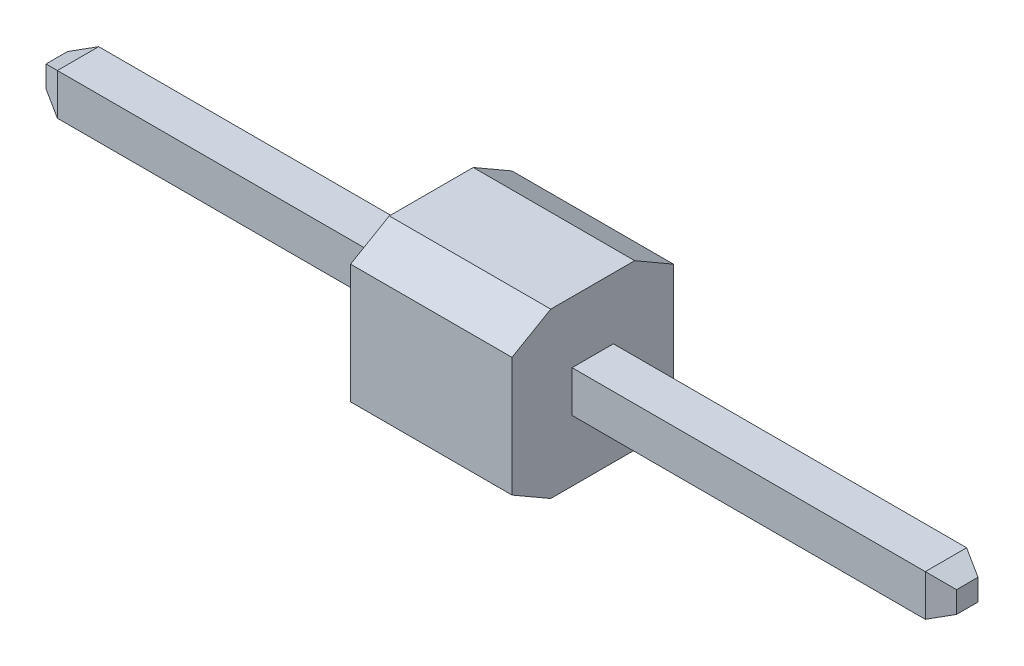
ISO-10303-21;
HEADER;
FILE_DESCRIPTION(('STEP AP214'),'2;1');
FILE_NAME('part.step','',(''),(''),'','','');
FILE_SCHEMA(('AUTOMOTIVE_DESIGN { 1 0 10303 214 1 1 1 1 }'));
ENDSEC;
DATA;
#1=APPLICATION_CONTEXT('core data for automotive mechanical design processes');
#2=APPLICATION_PROTOCOL_DEFINITION('international standard','automotive_design',2000,#1);
#3=PRODUCT_CONTEXT('',#1,'mechanical');
#4=PRODUCT('Part','Part','',(#3));
#5=PRODUCT_RELATED_PRODUCT_CATEGORY('part','',(#4));
#6=PRODUCT_DEFINITION_FORMATION('','',#4);
#7=PRODUCT_DEFINITION_CONTEXT('part definition',#1,'design');
#8=PRODUCT_DEFINITION('design','',#6,#7);
#9=PRODUCT_DEFINITION_SHAPE('','',#8);
#10=(LENGTH_UNIT() NAMED_UNIT(*) SI_UNIT(.MILLI.,.METRE.));
#11=(NAMED_UNIT(*) PLANE_ANGLE_UNIT() SI_UNIT($,.RADIAN.));
#12=(NAMED_UNIT(*) SI_UNIT($,.STERADIAN.) SOLID_ANGLE_UNIT());
#13=UNCERTAINTY_MEASURE_WITH_UNIT(LENGTH_MEASURE(1.E-05),#10,'distance_accuracy_value','');
#14=(GEOMETRIC_REPRESENTATION_CONTEXT(3) GLOBAL_UNCERTAINTY_ASSIGNED_CONTEXT((#13)) GLOBAL_UNIT_ASSIGNED_CONTEXT((#10,
#11,#12)) REPRESENTATION_CONTEXT('',''));
#15=CARTESIAN_POINT('',(0.,0.,0.));
#16=DIRECTION('',(0.,0.,1.));
#17=DIRECTION('',(1.,0.,0.));
#18=AXIS2_PLACEMENT_3D('',#15,#16,#17);
#19=CARTESIAN_POINT('',(5.42107615681275,5.39711572605714,-2.77112103967247));
#20=DIRECTION('',(1.,-9.93476518829084E-08,4.37113882867379E-08));
#21=DIRECTION('',(-9.93476589883358E-08,-1.,8.74227765734759E-08));
#22=AXIS2_PLACEMENT_3D('',#19,#20,#21);
#23=PLANE('',#22);
#24=DIRECTION('',(-1.18186619959584E-08,-0.500000075710541,-0.866025360072933));
#25=VECTOR('',#24,1.);
#26=CARTESIAN_POINT('',(5.42107596463815,4.15352602482091,-1.20112093095439));
#27=LINE('',#26,#25);
#28=CARTESIAN_POINT('',(5.42107596463815,4.15352602482091,-1.20112093095439));
#29=VERTEX_POINT('',#28);
#30=CARTESIAN_POINT('',(5.42107595644994,3.80711581085724,-1.80112090067026));
#31=VERTEX_POINT('',#30);
#32=EDGE_CURVE('E11',#29,#31,#27,.T.);
#33=ORIENTED_EDGE('',*,*,#32,.T.);
#34=DIRECTION('',(4.37113811813104E-08,-8.74227814926175E-08,-0.999999999999995));
#35=VECTOR('',#34,1.);
#36=CARTESIAN_POINT('',(5.42107595644994,3.80711581085724,-1.80112090067026));
#37=LINE('',#36,#35);
#38=CARTESIAN_POINT('',(5.42107601327473,3.80711569720762,-3.10112090067026));
#39=VERTEX_POINT('',#38);
#40=EDGE_CURVE('E304',#31,#39,#37,.T.);
#41=ORIENTED_EDGE('',*,*,#40,.T.);
#42=DIRECTION('',(8.75289950712043E-08,0.499999924289839,-0.866025447495711));
#43=VECTOR('',#42,1.);
#44=CARTESIAN_POINT('',(5.42107601327473,3.80711569720762,-3.10112090067026));
#45=LINE('',#44,#43);
#46=CARTESIAN_POINT('',(5.4210760739166,4.15352580626395,-3.70112093095439));
#47=VERTEX_POINT('',#46);
#48=EDGE_CURVE('E296',#39,#47,#45,.T.);
#49=ORIENTED_EDGE('',*,*,#48,.T.);
#50=DIRECTION('',(9.93476593244772E-08,0.999999999999991,-8.74227764822788E-08));
#51=VECTOR('',#50,1.);
#52=CARTESIAN_POINT('',(5.4210760739166,4.15352580626395,-3.70112093095439));
#53=LINE('',#52,#51);
#54=CARTESIAN_POINT('',(5.42107625742958,6.00070548323395,-3.70112109243997));
#55=VERTEX_POINT('',#54);
#56=EDGE_CURVE('E281',#47,#55,#53,.T.);
#57=ORIENTED_EDGE('',*,*,#56,.T.);
#58=DIRECTION('',(-1.18186632778483E-08,-0.500000075710533,-0.866025360072938));
#59=VECTOR('',#58,1.);
#60=CARTESIAN_POINT('',(5.42107626561779,6.34711569720762,-3.10112112272411));
#61=LINE('',#60,#59);
#62=CARTESIAN_POINT('',(5.42107626561779,6.34711569720762,-3.10112112272411));
#63=VERTEX_POINT('',#62);
#64=EDGE_CURVE('E265',#63,#55,#61,.T.);
#65=ORIENTED_EDGE('',*,*,#64,.F.);
#66=DIRECTION('',(4.37113811813104E-08,-8.74227842254741E-08,-0.999999999999995));
#67=VECTOR('',#66,1.);
#68=CARTESIAN_POINT('',(5.42107620879299,6.34711581085724,-1.80112112272411));
#69=LINE('',#68,#67);
#70=CARTESIAN_POINT('',(5.42107620879299,6.34711581085724,-1.80112112272411));
#71=VERTEX_POINT('',#70);
#72=EDGE_CURVE('E248',#71,#63,#69,.T.);
#73=ORIENTED_EDGE('',*,*,#72,.F.);
#74=DIRECTION('',(8.75289963525477E-08,0.499999924289836,-0.866025447495714));
#75=VECTOR('',#74,1.);
#76=CARTESIAN_POINT('',(5.42107614815112,6.00070570179091,-1.20112109243997));
#77=LINE('',#76,#75);
#78=CARTESIAN_POINT('',(5.42107614815112,6.00070570179091,-1.20112109243997));
#79=VERTEX_POINT('',#78);
#80=EDGE_CURVE('E242',#79,#71,#77,.T.);
#81=ORIENTED_EDGE('',*,*,#80,.F.);
#82=DIRECTION('',(9.93476593244772E-08,0.999999999999991,-8.74227763620714E-08));
#83=VECTOR('',#82,1.);
#84=CARTESIAN_POINT('',(5.42107596463815,4.15352602482091,-1.20112093095439));
#85=LINE('',#84,#83);
#86=EDGE_CURVE('E236',#29,#79,#85,.T.);
#87=ORIENTED_EDGE('',*,*,#86,.F.);
#88=EDGE_LOOP('',(#33,#41,#49,#57,#65,#73,#81,#87));
#89=FACE_BOUND('',#88,.T.);
#90=DIRECTION('',(-4.37113817364219E-08,8.74227856773042E-08,0.999999999999995));
#91=VECTOR('',#90,1.);
#92=CARTESIAN_POINT('',(5.42107609323025,4.75711572605714,-2.77112098372189));
#93=LINE('',#92,#91);
#94=CARTESIAN_POINT('',(5.42107609323025,4.75711572605714,-2.77112098372189));
#95=VERTEX_POINT('',#94);
#96=CARTESIAN_POINT('',(5.42107606525497,4.75711578200772,-2.13112098372189));
#97=VERTEX_POINT('',#96);
#98=EDGE_CURVE('E302',#95,#97,#93,.T.);
#99=ORIENTED_EDGE('',*,*,#98,.T.);
#100=DIRECTION('',(-9.93476592658906E-08,-0.999999999999991,8.74227766567418E-08));
#101=VECTOR('',#100,1.);
#102=CARTESIAN_POINT('',(5.42107612883747,5.39711578200772,-2.13112103967247));
#103=LINE('',#102,#101);
#104=CARTESIAN_POINT('',(5.42107612883747,5.39711578200772,-2.13112103967247));
#105=VERTEX_POINT('',#104);
#106=EDGE_CURVE('E293',#105,#97,#103,.T.);
#107=ORIENTED_EDGE('',*,*,#106,.F.);
#108=DIRECTION('',(-4.37113817364219E-08,8.74227856773042E-08,0.999999999999995));
#109=VECTOR('',#108,1.);
#110=CARTESIAN_POINT('',(5.42107615681275,5.39711572605714,-2.77112103967247));
#111=LINE('',#110,#109);
#112=CARTESIAN_POINT('',(5.42107615681275,5.39711572605714,-2.77112103967247));
#113=VERTEX_POINT('',#112);
#114=EDGE_CURVE('E278',#113,#105,#111,.T.);
#115=ORIENTED_EDGE('',*,*,#114,.F.);
#116=DIRECTION('',(-9.93476592658906E-08,-0.999999999999991,8.74227766567418E-08));
#117=VECTOR('',#116,1.);
#118=CARTESIAN_POINT('',(5.42107615681275,5.39711572605714,-2.77112103967247));
#119=LINE('',#118,#117);
#120=EDGE_CURVE('E263',#113,#95,#119,.T.);
#121=ORIENTED_EDGE('',*,*,#120,.T.);
#122=EDGE_LOOP('',(#99,#107,#115,#121));
#123=FACE_BOUND('',#122,.T.);
#124=ADVANCED_FACE('F17',(#89,#123),#23,.T.);
#125=CARTESIAN_POINT('',(2.92107615681275,5.39711597442627,-2.77112114895094));
#126=DIRECTION('',(1.,-9.93476518829084E-08,4.37113882867379E-08));
#127=DIRECTION('',(-9.93476589883358E-08,-1.,8.74227765734759E-08));
#128=AXIS2_PLACEMENT_3D('',#125,#126,#127);
#129=PLANE('',#128);
#130=DIRECTION('',(-1.1818662636946E-08,-0.500000075710541,-0.866025360072933));
#131=VECTOR('',#130,1.);
#132=CARTESIAN_POINT('',(2.92107596463815,4.15352627319004,-1.20112104023287));
#133=LINE('',#132,#131);
#134=CARTESIAN_POINT('',(2.92107596463815,4.15352627319004,-1.20112104023287));
#135=VERTEX_POINT('',#134);
#136=CARTESIAN_POINT('',(2.92107595644994,3.80711605922637,-1.80112100994873));
#137=VERTEX_POINT('',#136);
#138=EDGE_CURVE('E24',#135,#137,#133,.T.);
#139=ORIENTED_EDGE('',*,*,#138,.F.);
#140=DIRECTION('',(9.93476590840625E-08,0.999999999999991,-8.74227763620714E-08));
#141=VECTOR('',#140,1.);
#142=CARTESIAN_POINT('',(2.92107596463815,4.15352627319004,-1.20112104023287));
#143=LINE('',#142,#141);
#144=CARTESIAN_POINT('',(2.92107614815112,6.00070595016004,-1.20112120171844));
#145=VERTEX_POINT('',#144);
#146=EDGE_CURVE('E300',#135,#145,#143,.T.);
#147=ORIENTED_EDGE('',*,*,#146,.T.);
#148=DIRECTION('',(8.75289963525477E-08,0.499999924289836,-0.866025447495714));
#149=VECTOR('',#148,1.);
#150=CARTESIAN_POINT('',(2.92107614815112,6.00070595016004,-1.20112120171844));
#151=LINE('',#150,#149);
#152=CARTESIAN_POINT('',(2.92107620879299,6.34711605922637,-1.80112123200258));
#153=VERTEX_POINT('',#152);
#154=EDGE_CURVE('E286',#145,#153,#151,.T.);
#155=ORIENTED_EDGE('',*,*,#154,.T.);
#156=DIRECTION('',(4.37113811813104E-08,-8.74227842254741E-08,-0.999999999999995));
#157=VECTOR('',#156,1.);
#158=CARTESIAN_POINT('',(2.92107620879299,6.34711605922637,-1.80112123200258));
#159=LINE('',#158,#157);
#160=CARTESIAN_POINT('',(2.92107626561779,6.34711594557675,-3.10112123200258));
#161=VERTEX_POINT('',#160);
#162=EDGE_CURVE('E271',#153,#161,#159,.T.);
#163=ORIENTED_EDGE('',*,*,#162,.T.);
#164=DIRECTION('',(-1.18186632778483E-08,-0.500000075710533,-0.866025360072938));
#165=VECTOR('',#164,1.);
#166=CARTESIAN_POINT('',(2.92107626561779,6.34711594557675,-3.10112123200258));
#167=LINE('',#166,#165);
#168=CARTESIAN_POINT('',(2.92107625742958,6.00070573160308,-3.70112120171844));
#169=VERTEX_POINT('',#168);
#170=EDGE_CURVE('E253',#161,#169,#167,.T.);
#171=ORIENTED_EDGE('',*,*,#170,.T.);
#172=DIRECTION('',(9.93476590840625E-08,0.999999999999991,-8.74227764822788E-08));
#173=VECTOR('',#172,1.);
#174=CARTESIAN_POINT('',(2.9210760739166,4.15352605463308,-3.70112104023287));
#175=LINE('',#174,#173);
#176=CARTESIAN_POINT('',(2.9210760739166,4.15352605463308,-3.70112104023287));
#177=VERTEX_POINT('',#176);
#178=EDGE_CURVE('E261',#177,#169,#175,.T.);
#179=ORIENTED_EDGE('',*,*,#178,.F.);
#180=DIRECTION('',(8.75289957121919E-08,0.499999924289839,-0.866025447495711));
#181=VECTOR('',#180,1.);
#182=CARTESIAN_POINT('',(2.92107601327473,3.80711594557675,-3.10112100994873));
#183=LINE('',#182,#181);
#184=CARTESIAN_POINT('',(2.92107601327473,3.80711594557675,-3.10112100994873));
#185=VERTEX_POINT('',#184);
#186=EDGE_CURVE('E276',#185,#177,#183,.T.);
#187=ORIENTED_EDGE('',*,*,#186,.F.);
#188=DIRECTION('',(4.37113811813104E-08,-8.74227814926175E-08,-0.999999999999995));
#189=VECTOR('',#188,1.);
#190=CARTESIAN_POINT('',(2.92107595644994,3.80711605922637,-1.80112100994873));
#191=LINE('',#190,#189);
#192=EDGE_CURVE('E291',#137,#185,#191,.T.);
#193=ORIENTED_EDGE('',*,*,#192,.F.);
#194=EDGE_LOOP('',(#139,#147,#155,#163,#171,#179,#187,#193));
#195=FACE_BOUND('',#194,.T.);
#196=DIRECTION('',(-9.93476592658906E-08,-0.999999999999991,8.74227766567418E-08));
#197=VECTOR('',#196,1.);
#198=CARTESIAN_POINT('',(2.92107612883747,5.39711603037685,-2.13112114895094));
#199=LINE('',#198,#197);
#200=CARTESIAN_POINT('',(2.92107612883747,5.39711603037685,-2.13112114895094));
#201=VERTEX_POINT('',#200);
#202=CARTESIAN_POINT('',(2.92107606525497,4.75711603037685,-2.13112109300036));
#203=VERTEX_POINT('',#202);
#204=EDGE_CURVE('E298',#201,#203,#199,.T.);
#205=ORIENTED_EDGE('',*,*,#204,.T.);
#206=DIRECTION('',(-4.37113817364219E-08,8.74227856773042E-08,0.999999999999995));
#207=VECTOR('',#206,1.);
#208=CARTESIAN_POINT('',(2.92107609323025,4.75711597442627,-2.77112109300037));
#209=LINE('',#208,#207);
#210=CARTESIAN_POINT('',(2.92107609323025,4.75711597442627,-2.77112109300037));
#211=VERTEX_POINT('',#210);
#212=EDGE_CURVE('E283',#211,#203,#209,.T.);
#213=ORIENTED_EDGE('',*,*,#212,.F.);
#214=DIRECTION('',(-9.93476585720012E-08,-0.999999999999991,8.74227766567418E-08));
#215=VECTOR('',#214,1.);
#216=CARTESIAN_POINT('',(2.92107615681275,5.39711597442627,-2.77112114895094));
#217=LINE('',#216,#215);
#218=CARTESIAN_POINT('',(2.92107615681275,5.39711597442627,-2.77112114895094));
#219=VERTEX_POINT('',#218);
#220=EDGE_CURVE('E268',#219,#211,#217,.T.);
#221=ORIENTED_EDGE('',*,*,#220,.F.);
#222=DIRECTION('',(-4.37113810425325E-08,8.74227856773042E-08,0.999999999999995));
#223=VECTOR('',#222,1.);
#224=CARTESIAN_POINT('',(2.92107615681275,5.39711597442627,-2.77112114895094));
#225=LINE('',#224,#223);
#226=EDGE_CURVE('E251',#219,#201,#225,.T.);
#227=ORIENTED_EDGE('',*,*,#226,.T.);
#228=EDGE_LOOP('',(#205,#213,#221,#227));
#229=FACE_BOUND('',#228,.T.);
#230=ADVANCED_FACE('F314',(#195,#229),#129,.F.);
#231=CARTESIAN_POINT('',(5.42107596463815,4.15352602482091,-1.20112093095439));
#232=DIRECTION('',(1.07893287081065E-07,0.866025360072937,-0.500000075710535));
#233=DIRECTION('',(1.18186629566715E-08,0.500000075710542,0.866025360072941));
#234=AXIS2_PLACEMENT_3D('',#231,#232,#233);
#235=PLANE('',#234);
#236=ORIENTED_EDGE('',*,*,#138,.T.);
#237=DIRECTION('',(-0.999999999999994,9.93476504618223E-08,-4.37113883755555E-08));
#238=VECTOR('',#237,1.);
#239=CARTESIAN_POINT('',(5.42107595644994,3.80711581085724,-1.80112090067026));
#240=LINE('',#239,#238);
#241=EDGE_CURVE('E288',#31,#137,#240,.T.);
#242=ORIENTED_EDGE('',*,*,#241,.F.);
#243=ORIENTED_EDGE('',*,*,#32,.F.);
#244=DIRECTION('',(-0.999999999999994,9.93476504618224E-08,-4.3711388109102E-08));
#245=VECTOR('',#244,1.);
#246=CARTESIAN_POINT('',(5.42107596463815,4.15352602482091,-1.20112093095439));
#247=LINE('',#246,#245);
#248=EDGE_CURVE('E256',#29,#135,#247,.T.);
#249=ORIENTED_EDGE('',*,*,#248,.T.);
#250=EDGE_LOOP('',(#236,#242,#243,#249));
#251=FACE_BOUND('',#250,.T.);
#252=ADVANCED_FACE('F306',(#251),#235,.F.);
#253=CARTESIAN_POINT('',(5.42107595644994,3.80711581085724,-1.80112090067026));
#254=DIRECTION('',(9.93476589883358E-08,1.,-8.74227765734759E-08));
#255=DIRECTION('',(1.,-9.93476518829084E-08,4.37113882867379E-08));
#256=AXIS2_PLACEMENT_3D('',#253,#254,#255);
#257=PLANE('',#256);
#258=ORIENTED_EDGE('',*,*,#192,.T.);
#259=DIRECTION('',(-0.999999999999994,9.93476504618223E-08,-4.37113882867377E-08));
#260=VECTOR('',#259,1.);
#261=CARTESIAN_POINT('',(5.42107601327473,3.80711569720762,-3.10112090067026));
#262=LINE('',#261,#260);
#263=EDGE_CURVE('E273',#39,#185,#262,.T.);
#264=ORIENTED_EDGE('',*,*,#263,.F.);
#265=ORIENTED_EDGE('',*,*,#40,.F.);
#266=ORIENTED_EDGE('',*,*,#241,.T.);
#267=EDGE_LOOP('',(#258,#264,#265,#266));
#268=FACE_BOUND('',#267,.T.);
#269=ADVANCED_FACE('F311',(#268),#257,.F.);
#270=CARTESIAN_POINT('',(5.42107601327473,3.80711569720762,-3.10112090067026));
#271=DIRECTION('',(6.41819058997377E-08,0.866025447495721,0.499999924289845));
#272=DIRECTION('',(-8.7528996031702E-08,-0.499999924289838,0.866025447495717));
#273=AXIS2_PLACEMENT_3D('',#270,#271,#272);
#274=PLANE('',#273);
#275=ORIENTED_EDGE('',*,*,#186,.T.);
#276=DIRECTION('',(-0.999999999999994,9.93476504618224E-08,-4.37113882867377E-08));
#277=VECTOR('',#276,1.);
#278=CARTESIAN_POINT('',(5.4210760739166,4.15352580626395,-3.70112093095439));
#279=LINE('',#278,#277);
#280=EDGE_CURVE('E258',#47,#177,#279,.T.);
#281=ORIENTED_EDGE('',*,*,#280,.F.);
#282=ORIENTED_EDGE('',*,*,#48,.F.);
#283=ORIENTED_EDGE('',*,*,#263,.T.);
#284=EDGE_LOOP('',(#275,#281,#282,#283));
#285=FACE_BOUND('',#284,.T.);
#286=ADVANCED_FACE('F319',(#285),#274,.F.);
#287=CARTESIAN_POINT('',(5.4210760739166,4.15352580626395,-3.70112093095439));
#288=DIRECTION('',(-4.37113811813106E-08,8.74227836789032E-08,1.));
#289=DIRECTION('',(-1.,9.93476518829084E-08,-4.37113882867379E-08));
#290=AXIS2_PLACEMENT_3D('',#287,#288,#289);
#291=PLANE('',#290);
#292=ORIENTED_EDGE('',*,*,#178,.T.);
#293=DIRECTION('',(-0.999999999999994,9.93476504618223E-08,-4.37113882867377E-08));
#294=VECTOR('',#293,1.);
#295=CARTESIAN_POINT('',(5.42107625742958,6.00070548323395,-3.70112109243997));
#296=LINE('',#295,#294);
#297=EDGE_CURVE('E245',#55,#169,#296,.T.);
#298=ORIENTED_EDGE('',*,*,#297,.F.);
#299=ORIENTED_EDGE('',*,*,#56,.F.);
#300=ORIENTED_EDGE('',*,*,#280,.T.);
#301=EDGE_LOOP('',(#292,#298,#299,#300));
#302=FACE_BOUND('',#301,.T.);
#303=ADVANCED_FACE('F326',(#302),#291,.F.);
#304=CARTESIAN_POINT('',(5.42107626561779,6.34711569720762,-3.10112112272411));
#305=DIRECTION('',(1.07893287081065E-07,0.866025360072937,-0.500000075710535));
#306=DIRECTION('',(1.18186629566715E-08,0.500000075710542,0.866025360072941));
#307=AXIS2_PLACEMENT_3D('',#304,#305,#306);
#308=PLANE('',#307);
#309=ORIENTED_EDGE('',*,*,#170,.F.);
#310=DIRECTION('',(-0.999999999999994,9.93476533039933E-08,-4.37113882867377E-08));
#311=VECTOR('',#310,1.);
#312=CARTESIAN_POINT('',(5.42107626561779,6.34711569720762,-3.10112112272411));
#313=LINE('',#312,#311);
#314=EDGE_CURVE('E239',#63,#161,#313,.T.);
#315=ORIENTED_EDGE('',*,*,#314,.F.);
#316=ORIENTED_EDGE('',*,*,#64,.T.);
#317=ORIENTED_EDGE('',*,*,#297,.T.);
#318=EDGE_LOOP('',(#309,#315,#316,#317));
#319=FACE_BOUND('',#318,.T.);
#320=ADVANCED_FACE('F329',(#319),#308,.T.);
#321=CARTESIAN_POINT('',(5.42107620879299,6.34711581085724,-1.80112112272411));
#322=DIRECTION('',(9.93476589883358E-08,1.,-8.74227765734759E-08));
#323=DIRECTION('',(1.,-9.93476518829084E-08,4.37113882867379E-08));
#324=AXIS2_PLACEMENT_3D('',#321,#322,#323);
#325=PLANE('',#324);
#326=ORIENTED_EDGE('',*,*,#162,.F.);
#327=DIRECTION('',(-0.999999999999994,9.93476533039933E-08,-4.37113882867377E-08));
#328=VECTOR('',#327,1.);
#329=CARTESIAN_POINT('',(5.42107620879299,6.34711581085724,-1.80112112272411));
#330=LINE('',#329,#328);
#331=EDGE_CURVE('E233',#71,#153,#330,.T.);
#332=ORIENTED_EDGE('',*,*,#331,.F.);
#333=ORIENTED_EDGE('',*,*,#72,.T.);
#334=ORIENTED_EDGE('',*,*,#314,.T.);
#335=EDGE_LOOP('',(#326,#332,#333,#334));
#336=FACE_BOUND('',#335,.T.);
#337=ADVANCED_FACE('F333',(#336),#325,.T.);
#338=CARTESIAN_POINT('',(5.42107614815112,6.00070570179091,-1.20112109243997));
#339=DIRECTION('',(6.41819058997377E-08,0.866025447495721,0.499999924289845));
#340=DIRECTION('',(-8.7528996031702E-08,-0.499999924289838,0.866025447495717));
#341=AXIS2_PLACEMENT_3D('',#338,#339,#340);
#342=PLANE('',#341);
#343=ORIENTED_EDGE('',*,*,#154,.F.);
#344=DIRECTION('',(-0.999999999999994,9.93476504618223E-08,-4.3711388109102E-08));
#345=VECTOR('',#344,1.);
#346=CARTESIAN_POINT('',(5.42107614815112,6.00070570179091,-1.20112109243997));
#347=LINE('',#346,#345);
#348=EDGE_CURVE('E230',#79,#145,#347,.T.);
#349=ORIENTED_EDGE('',*,*,#348,.F.);
#350=ORIENTED_EDGE('',*,*,#80,.T.);
#351=ORIENTED_EDGE('',*,*,#331,.T.);
#352=EDGE_LOOP('',(#343,#349,#350,#351));
#353=FACE_BOUND('',#352,.T.);
#354=ADVANCED_FACE('F337',(#353),#342,.T.);
#355=CARTESIAN_POINT('',(5.42107596463815,4.15352602482091,-1.20112093095439));
#356=DIRECTION('',(-4.37113811813106E-08,8.74227835615132E-08,1.));
#357=DIRECTION('',(-9.93476589883358E-08,-1.,8.74227764560859E-08));
#358=AXIS2_PLACEMENT_3D('',#355,#356,#357);
#359=PLANE('',#358);
#360=ORIENTED_EDGE('',*,*,#146,.F.);
#361=ORIENTED_EDGE('',*,*,#248,.F.);
#362=ORIENTED_EDGE('',*,*,#86,.T.);
#363=ORIENTED_EDGE('',*,*,#348,.T.);
#364=EDGE_LOOP('',(#360,#361,#362,#363));
#365=FACE_BOUND('',#364,.T.);
#366=ADVANCED_FACE('F339',(#365),#359,.T.);
#367=CARTESIAN_POINT('',(-2.87892384318725,5.39711655064265,-2.77112140247699));
#368=DIRECTION('',(-1.,9.93476518829084E-08,-4.37113882867379E-08));
#369=DIRECTION('',(9.93476589883358E-08,1.,-8.74227765734759E-08));
#370=AXIS2_PLACEMENT_3D('',#367,#368,#369);
#371=PLANE('',#370);
#372=DIRECTION('',(9.93476581477908E-08,0.999999999999991,-8.74227761415111E-08));
#373=VECTOR('',#372,1.);
#374=CARTESIAN_POINT('',(-2.87892391273089,4.91099812033048,-2.28500288717017));
#375=LINE('',#374,#373);
#376=CARTESIAN_POINT('',(-2.87892391273089,4.91099812033048,-2.28500288717017));
#377=VERTEX_POINT('',#376);
#378=CARTESIAN_POINT('',(-2.87892387972393,5.24323506594048,-2.28500291621524));
#379=VERTEX_POINT('',#378);
#380=EDGE_CURVE('E228',#377,#379,#375,.T.);
#381=ORIENTED_EDGE('',*,*,#380,.T.);
#382=DIRECTION('',(4.37113793813866E-08,-8.74227854960559E-08,-0.999999999999995));
#383=VECTOR('',#382,1.);
#384=CARTESIAN_POINT('',(-2.87892387972393,5.24323506594048,-2.28500291621524));
#385=LINE('',#384,#383);
#386=CARTESIAN_POINT('',(-2.87892386520139,5.2432350368954,-2.61723986183324));
#387=VERTEX_POINT('',#386);
#388=EDGE_CURVE('E223',#379,#387,#385,.T.);
#389=ORIENTED_EDGE('',*,*,#388,.T.);
#390=DIRECTION('',(-9.93476608211191E-08,-0.999999999999991,8.74227774781752E-08));
#391=VECTOR('',#390,1.);
#392=CARTESIAN_POINT('',(-2.87892386520139,5.2432350368954,-2.61723986183324));
#393=LINE('',#392,#391);
#394=CARTESIAN_POINT('',(-2.87892389820835,4.9109980912854,-2.61723983278817));
#395=VERTEX_POINT('',#394);
#396=EDGE_CURVE('E215',#387,#395,#393,.T.);
#397=ORIENTED_EDGE('',*,*,#396,.T.);
#398=DIRECTION('',(-4.37113767080584E-08,8.74227854960561E-08,0.999999999999995));
#399=VECTOR('',#398,1.);
#400=CARTESIAN_POINT('',(-2.87892389820835,4.9109980912854,-2.61723983278817));
#401=LINE('',#400,#399);
#402=EDGE_CURVE('E207',#395,#377,#401,.T.);
#403=ORIENTED_EDGE('',*,*,#402,.T.);
#404=EDGE_LOOP('',(#381,#389,#397,#403));
#405=FACE_BOUND('',#404,.T.);
#406=ADVANCED_FACE('F341',(#405),#371,.T.);
#407=CARTESIAN_POINT('',(-2.87892384318725,5.39711655064265,-2.77112140247699));
#408=DIRECTION('',(9.93476589883358E-08,1.,-8.74227764510112E-08));
#409=DIRECTION('',(-4.37113811813106E-08,8.74227835564385E-08,1.));
#410=AXIS2_PLACEMENT_3D('',#407,#408,#409);
#411=PLANE('',#410);
#412=DIRECTION('',(0.999999999999994,-9.93476521037346E-08,4.37113882769953E-08));
#413=VECTOR('',#412,1.);
#414=CARTESIAN_POINT('',(-2.54892384318725,5.39711651785793,-2.77112138805224));
#415=LINE('',#414,#413);
#416=CARTESIAN_POINT('',(-2.54892384318725,5.39711651785793,-2.77112138805224));
#417=VERTEX_POINT('',#416);
#418=EDGE_CURVE('E225',#417,#219,#415,.T.);
#419=ORIENTED_EDGE('',*,*,#418,.F.);
#420=DIRECTION('',(-4.37113817364219E-08,8.74227856773042E-08,0.999999999999995));
#421=VECTOR('',#420,1.);
#422=CARTESIAN_POINT('',(-2.54892384318725,5.39711651785793,-2.77112138805224));
#423=LINE('',#422,#421);
#424=CARTESIAN_POINT('',(-2.54892387116253,5.39711657380851,-2.13112138805224));
#425=VERTEX_POINT('',#424);
#426=EDGE_CURVE('E217',#417,#425,#423,.T.);
#427=ORIENTED_EDGE('',*,*,#426,.T.);
#428=DIRECTION('',(0.999999999999994,-9.93476521037346E-08,4.3711388195809E-08));
#429=VECTOR('',#428,1.);
#430=CARTESIAN_POINT('',(-2.54892387116253,5.39711657380851,-2.13112138805224));
#431=LINE('',#430,#429);
#432=EDGE_CURVE('E220',#425,#201,#431,.T.);
#433=ORIENTED_EDGE('',*,*,#432,.T.);
#434=ORIENTED_EDGE('',*,*,#226,.F.);
#435=EDGE_LOOP('',(#419,#427,#433,#434));
#436=FACE_BOUND('',#435,.T.);
#437=ADVANCED_FACE('F348',(#436),#411,.T.);
#438=CARTESIAN_POINT('',(-2.87892387116253,5.39711660659323,-2.13112140247699));
#439=DIRECTION('',(-4.37113811813106E-08,8.74227836789032E-08,1.));
#440=DIRECTION('',(-1.,9.93476518829084E-08,-4.37113882867379E-08));
#441=AXIS2_PLACEMENT_3D('',#438,#439,#440);
#442=PLANE('',#441);
#443=ORIENTED_EDGE('',*,*,#432,.F.);
#444=DIRECTION('',(-9.93476592658906E-08,-0.999999999999991,8.74227766567418E-08));
#445=VECTOR('',#444,1.);
#446=CARTESIAN_POINT('',(-2.54892387116253,5.39711657380851,-2.13112138805224));
#447=LINE('',#446,#445);
#448=CARTESIAN_POINT('',(-2.54892393474503,4.75711657380851,-2.13112133210166));
#449=VERTEX_POINT('',#448);
#450=EDGE_CURVE('E209',#425,#449,#447,.T.);
#451=ORIENTED_EDGE('',*,*,#450,.T.);
#452=DIRECTION('',(0.999999999999994,-9.93476521037346E-08,4.3711388195809E-08));
#453=VECTOR('',#452,1.);
#454=CARTESIAN_POINT('',(-2.54892393474503,4.75711657380851,-2.13112133210166));
#455=LINE('',#454,#453);
#456=EDGE_CURVE('E212',#449,#203,#455,.T.);
#457=ORIENTED_EDGE('',*,*,#456,.T.);
#458=ORIENTED_EDGE('',*,*,#204,.F.);
#459=EDGE_LOOP('',(#443,#451,#457,#458));
#460=FACE_BOUND('',#459,.T.);
#461=ADVANCED_FACE('F424',(#460),#442,.T.);
#462=CARTESIAN_POINT('',(-2.87892390676975,4.75711655064265,-2.77112134652642));
#463=DIRECTION('',(9.93476589883357E-08,1.,-8.74227764040693E-08));
#464=DIRECTION('',(-4.37113811813106E-08,8.74227835094966E-08,1.));
#465=AXIS2_PLACEMENT_3D('',#462,#463,#464);
#466=PLANE('',#465);
#467=ORIENTED_EDGE('',*,*,#456,.F.);
#468=DIRECTION('',(4.37113831242006E-08,-8.74227912284193E-08,-0.999999999999995));
#469=VECTOR('',#468,1.);
#470=CARTESIAN_POINT('',(-2.54892393474503,4.75711657380851,-2.13112133210166));
#471=LINE('',#470,#469);
#472=CARTESIAN_POINT('',(-2.54892390676975,4.75711651785793,-2.77112133210166));
#473=VERTEX_POINT('',#472);
#474=EDGE_CURVE('E201',#449,#473,#471,.T.);
#475=ORIENTED_EDGE('',*,*,#474,.T.);
#476=DIRECTION('',(0.999999999999994,-9.93476521037346E-08,4.37113882769953E-08));
#477=VECTOR('',#476,1.);
#478=CARTESIAN_POINT('',(-2.54892390676975,4.75711651785793,-2.77112133210166));
#479=LINE('',#478,#477);
#480=EDGE_CURVE('E204',#473,#211,#479,.T.);
#481=ORIENTED_EDGE('',*,*,#480,.T.);
#482=ORIENTED_EDGE('',*,*,#212,.T.);
#483=EDGE_LOOP('',(#467,#475,#481,#482));
#484=FACE_BOUND('',#483,.T.);
#485=ADVANCED_FACE('F421',(#484),#466,.F.);
#486=CARTESIAN_POINT('',(-2.87892384318725,5.39711655064265,-2.77112140247699));
#487=DIRECTION('',(-4.37113811813106E-08,8.74227836789032E-08,1.));
#488=DIRECTION('',(-1.,9.93476518829084E-08,-4.37113882867379E-08));
#489=AXIS2_PLACEMENT_3D('',#486,#487,#488);
#490=PLANE('',#489);
#491=ORIENTED_EDGE('',*,*,#480,.F.);
#492=DIRECTION('',(9.93476578781118E-08,0.999999999999991,-8.74227766567418E-08));
#493=VECTOR('',#492,1.);
#494=CARTESIAN_POINT('',(-2.54892390676975,4.75711651785793,-2.77112133210166));
#495=LINE('',#494,#493);
#496=EDGE_CURVE('E196',#473,#417,#495,.T.);
#497=ORIENTED_EDGE('',*,*,#496,.T.);
#498=ORIENTED_EDGE('',*,*,#418,.T.);
#499=ORIENTED_EDGE('',*,*,#220,.T.);
#500=EDGE_LOOP('',(#491,#497,#498,#499));
#501=FACE_BOUND('',#500,.T.);
#502=ADVANCED_FACE('F376',(#501),#490,.F.);
#503=CARTESIAN_POINT('',(-2.87892384318725,5.39711655064265,-2.77112140247699));
#504=DIRECTION('',(-4.37113811813106E-08,8.74227836789032E-08,1.));
#505=DIRECTION('',(-1.,9.93476518829084E-08,-4.37113882867379E-08));
#506=AXIS2_PLACEMENT_3D('',#503,#504,#505);
#507=PLANE('',#506);
#508=DIRECTION('',(0.999999999999994,-9.93476521037346E-08,4.37113882769953E-08));
#509=VECTOR('',#508,1.);
#510=CARTESIAN_POINT('',(5.42107615681275,5.39711572605714,-2.77112103967247));
#511=LINE('',#510,#509);
#512=CARTESIAN_POINT('',(10.8910761568128,5.39711518262548,-2.77112080057118));
#513=VERTEX_POINT('',#512);
#514=EDGE_CURVE('E199',#113,#513,#511,.T.);
#515=ORIENTED_EDGE('',*,*,#514,.T.);
#516=DIRECTION('',(-9.93476634292269E-08,-0.999999999999991,8.74227766567418E-08));
#517=VECTOR('',#516,1.);
#518=CARTESIAN_POINT('',(10.8910761568128,5.39711518262548,-2.77112080057118));
#519=LINE('',#518,#517);
#520=CARTESIAN_POINT('',(10.8910760932303,4.75711518262548,-2.7711207446206));
#521=VERTEX_POINT('',#520);
#522=EDGE_CURVE('E191',#513,#521,#519,.T.);
#523=ORIENTED_EDGE('',*,*,#522,.T.);
#524=DIRECTION('',(0.999999999999994,-9.93476572996596E-08,4.37113882769953E-08));
#525=VECTOR('',#524,1.);
#526=CARTESIAN_POINT('',(5.42107609323025,4.75711572605715,-2.77112098372189));
#527=LINE('',#526,#525);
#528=EDGE_CURVE('E194',#95,#521,#527,.T.);
#529=ORIENTED_EDGE('',*,*,#528,.F.);
#530=ORIENTED_EDGE('',*,*,#120,.F.);
#531=EDGE_LOOP('',(#515,#523,#529,#530));
#532=FACE_BOUND('',#531,.T.);
#533=ADVANCED_FACE('F367',(#532),#507,.F.);
#534=CARTESIAN_POINT('',(-2.87892390676975,4.75711655064265,-2.77112134652642));
#535=DIRECTION('',(9.93476589883357E-08,1.,-8.74227764040693E-08));
#536=DIRECTION('',(-4.37113811813106E-08,8.74227835094966E-08,1.));
#537=AXIS2_PLACEMENT_3D('',#534,#535,#536);
#538=PLANE('',#537);
#539=ORIENTED_EDGE('',*,*,#528,.T.);
#540=DIRECTION('',(-4.37113817364219E-08,8.74227856773042E-08,0.999999999999995));
#541=VECTOR('',#540,1.);
#542=CARTESIAN_POINT('',(10.8910760932303,4.75711518262548,-2.7711207446206));
#543=LINE('',#542,#541);
#544=CARTESIAN_POINT('',(10.891076065255,4.75711523857607,-2.1311207446206));
#545=VERTEX_POINT('',#544);
#546=EDGE_CURVE('E186',#521,#545,#543,.T.);
#547=ORIENTED_EDGE('',*,*,#546,.T.);
#548=DIRECTION('',(0.999999999999994,-9.93476572996596E-08,4.37113881146227E-08));
#549=VECTOR('',#548,1.);
#550=CARTESIAN_POINT('',(5.42107606525497,4.75711578200774,-2.13112098372189));
#551=LINE('',#550,#549);
#552=EDGE_CURVE('E189',#97,#545,#551,.T.);
#553=ORIENTED_EDGE('',*,*,#552,.F.);
#554=ORIENTED_EDGE('',*,*,#98,.F.);
#555=EDGE_LOOP('',(#539,#547,#553,#554));
#556=FACE_BOUND('',#555,.T.);
#557=ADVANCED_FACE('F364',(#556),#538,.F.);
#558=CARTESIAN_POINT('',(-2.87892387116253,5.39711660659323,-2.13112140247699));
#559=DIRECTION('',(-4.37113811813106E-08,8.74227836789032E-08,1.));
#560=DIRECTION('',(-1.,9.93476518829084E-08,-4.37113882867379E-08));
#561=AXIS2_PLACEMENT_3D('',#558,#559,#560);
#562=PLANE('',#561);
#563=ORIENTED_EDGE('',*,*,#552,.T.);
#564=DIRECTION('',(9.93476578781118E-08,0.999999999999991,-8.74227759628524E-08));
#565=VECTOR('',#564,1.);
#566=CARTESIAN_POINT('',(10.891076065255,4.75711523857607,-2.1311207446206));
#567=LINE('',#566,#565);
#568=CARTESIAN_POINT('',(10.8910761288375,5.39711523857607,-2.13112080057118));
#569=VERTEX_POINT('',#568);
#570=EDGE_CURVE('E176',#545,#569,#567,.T.);
#571=ORIENTED_EDGE('',*,*,#570,.T.);
#572=DIRECTION('',(0.999999999999994,-9.93476521037346E-08,4.37113881146227E-08));
#573=VECTOR('',#572,1.);
#574=CARTESIAN_POINT('',(5.42107612883747,5.39711578200772,-2.13112103967247));
#575=LINE('',#574,#573);
#576=EDGE_CURVE('E179',#105,#569,#575,.T.);
#577=ORIENTED_EDGE('',*,*,#576,.F.);
#578=ORIENTED_EDGE('',*,*,#106,.T.);
#579=EDGE_LOOP('',(#563,#571,#577,#578));
#580=FACE_BOUND('',#579,.T.);
#581=ADVANCED_FACE('F366',(#580),#562,.T.);
#582=CARTESIAN_POINT('',(-2.87892384318725,5.39711655064265,-2.77112140247699));
#583=DIRECTION('',(9.93476589883358E-08,1.,-8.74227764510112E-08));
#584=DIRECTION('',(-4.37113811813106E-08,8.74227835564385E-08,1.));
#585=AXIS2_PLACEMENT_3D('',#582,#583,#584);
#586=PLANE('',#585);
#587=ORIENTED_EDGE('',*,*,#576,.T.);
#588=DIRECTION('',(4.37113817364219E-08,-8.74227912284193E-08,-0.999999999999995));
#589=VECTOR('',#588,1.);
#590=CARTESIAN_POINT('',(10.8910761288375,5.39711523857607,-2.13112080057118));
#591=LINE('',#590,#589);
#592=EDGE_CURVE('E167',#569,#513,#591,.T.);
#593=ORIENTED_EDGE('',*,*,#592,.T.);
#594=ORIENTED_EDGE('',*,*,#514,.F.);
#595=ORIENTED_EDGE('',*,*,#114,.T.);
#596=EDGE_LOOP('',(#587,#593,#594,#595));
#597=FACE_BOUND('',#596,.T.);
#598=ADVANCED_FACE('F373',(#597),#586,.T.);
#599=CARTESIAN_POINT('',(11.2210761568128,5.39711514984076,-2.77112078614642));
#600=DIRECTION('',(-1.,9.93476518829084E-08,-4.37113882867379E-08));
#601=DIRECTION('',(9.93476589883358E-08,1.,-8.74227765734759E-08));
#602=AXIS2_PLACEMENT_3D('',#599,#600,#601);
#603=PLANE('',#602);
#604=DIRECTION('',(-9.93476581477908E-08,-0.999999999999991,8.74227774781752E-08));
#605=VECTOR('',#604,1.);
#606=CARTESIAN_POINT('',(11.2210761202761,5.24323366513859,-2.28500229988467));
#607=LINE('',#606,#605);
#608=CARTESIAN_POINT('',(11.2210761202761,5.24323366513859,-2.28500229988467));
#609=VERTEX_POINT('',#608);
#610=CARTESIAN_POINT('',(11.2210760872691,4.91099671952859,-2.28500227083959));
#611=VERTEX_POINT('',#610);
#612=EDGE_CURVE('E153',#609,#611,#607,.T.);
#613=ORIENTED_EDGE('',*,*,#612,.T.);
#614=DIRECTION('',(4.37113820547149E-08,-8.74227854960559E-08,-0.999999999999995));
#615=VECTOR('',#614,1.);
#616=CARTESIAN_POINT('',(11.2210760872691,4.91099671952859,-2.28500227083959));
#617=LINE('',#616,#615);
#618=CARTESIAN_POINT('',(11.2210761017916,4.91099669048351,-2.61723921645759));
#619=VERTEX_POINT('',#618);
#620=EDGE_CURVE('E395',#611,#619,#617,.T.);
#621=ORIENTED_EDGE('',*,*,#620,.T.);
#622=DIRECTION('',(9.93476581477908E-08,0.999999999999991,-8.74227761415111E-08));
#623=VECTOR('',#622,1.);
#624=CARTESIAN_POINT('',(11.2210761017916,4.91099669048351,-2.61723921645759));
#625=LINE('',#624,#623);
#626=CARTESIAN_POINT('',(11.2210761347986,5.24323363609351,-2.61723924550267));
#627=VERTEX_POINT('',#626);
#628=EDGE_CURVE('E156',#619,#627,#625,.T.);
#629=ORIENTED_EDGE('',*,*,#628,.T.);
#630=DIRECTION('',(-4.37113874013715E-08,8.7422774802743E-08,0.999999999999995));
#631=VECTOR('',#630,1.);
#632=CARTESIAN_POINT('',(11.2210761347986,5.24323363609351,-2.61723924550267));
#633=LINE('',#632,#631);
#634=EDGE_CURVE('E149',#627,#609,#633,.T.);
#635=ORIENTED_EDGE('',*,*,#634,.T.);
#636=EDGE_LOOP('',(#613,#621,#629,#635));
#637=FACE_BOUND('',#636,.T.);
#638=ADVANCED_FACE('F151',(#637),#603,.F.);
#639=CARTESIAN_POINT('',(-2.87892389148198,4.91099807783265,-2.77112135997917));
#640=DIRECTION('',(-0.422618351780369,-0.906307745050466,6.07587120833484E-08));
#641=DIRECTION('',(4.37113811813106E-08,-8.74227835094966E-08,-1.));
#642=AXIS2_PLACEMENT_3D('',#639,#640,#641);
#643=PLANE('',#642);
#644=DIRECTION('',(0.834817073788752,-0.389281669540033,0.389281691158098));
#645=VECTOR('',#644,1.);
#646=CARTESIAN_POINT('',(-2.87892391273091,4.91099812032996,-2.28500288717065));
#647=LINE('',#646,#645);
#648=EDGE_CURVE('E181',#377,#449,#647,.T.);
#649=ORIENTED_EDGE('',*,*,#648,.F.);
#650=ORIENTED_EDGE('',*,*,#402,.F.);
#651=DIRECTION('',(-0.834817107820823,0.389281737604207,0.389281550111904));
#652=VECTOR('',#651,1.);
#653=CARTESIAN_POINT('',(-2.54892390677018,4.75711651785646,-2.77112133210112));
#654=LINE('',#653,#652);
#655=EDGE_CURVE('E404',#473,#395,#654,.T.);
#656=ORIENTED_EDGE('',*,*,#655,.F.);
#657=ORIENTED_EDGE('',*,*,#474,.F.);
#658=EDGE_LOOP('',(#649,#650,#656,#657));
#659=FACE_BOUND('',#658,.T.);
#660=ADVANCED_FACE('F418',(#659),#643,.T.);
#661=CARTESIAN_POINT('',(-2.87892384991362,5.3971165640954,-2.61723987528599));
#662=DIRECTION('',(-0.422618222124847,-3.72458176658199E-08,-0.906307805509828));
#663=DIRECTION('',(9.93476589883358E-08,1.,-8.74227765734759E-08));
#664=AXIS2_PLACEMENT_3D('',#661,#662,#663);
#665=PLANE('',#664);
#666=ORIENTED_EDGE('',*,*,#655,.T.);
#667=ORIENTED_EDGE('',*,*,#396,.F.);
#668=DIRECTION('',(-0.834817185169258,-0.389281503665794,0.389281618176064));
#669=VECTOR('',#668,1.);
#670=CARTESIAN_POINT('',(-2.5489238431861,5.3971165178552,-2.77112138805251));
#671=LINE('',#670,#669);
#672=EDGE_CURVE('E160',#417,#387,#671,.T.);
#673=ORIENTED_EDGE('',*,*,#672,.F.);
#674=ORIENTED_EDGE('',*,*,#496,.F.);
#675=EDGE_LOOP('',(#666,#667,#673,#674));
#676=FACE_BOUND('',#675,.T.);
#677=ADVANCED_FACE('F434',(#676),#665,.T.);
#678=CARTESIAN_POINT('',(-2.54892387116253,5.39711657380851,-2.13112138805224));
#679=DIRECTION('',(0.422618301356777,-1.21218081559392E-07,-0.906307768563367));
#680=DIRECTION('',(-9.93476589883358E-08,-1.,8.74227765734759E-08));
#681=AXIS2_PLACEMENT_3D('',#678,#679,#680);
#682=PLANE('',#681);
#683=ORIENTED_EDGE('',*,*,#648,.T.);
#684=ORIENTED_EDGE('',*,*,#450,.F.);
#685=DIRECTION('',(0.834817151137179,0.38928157172997,0.389281623093935));
#686=VECTOR('',#685,1.);
#687=CARTESIAN_POINT('',(-2.87892387972676,5.24323506594802,-2.2850029162167));
#688=LINE('',#687,#686);
#689=EDGE_CURVE('E170',#379,#425,#688,.T.);
#690=ORIENTED_EDGE('',*,*,#689,.F.);
#691=ORIENTED_EDGE('',*,*,#380,.F.);
#692=EDGE_LOOP('',(#683,#684,#690,#691));
#693=FACE_BOUND('',#692,.T.);
#694=ADVANCED_FACE('F413',(#693),#682,.F.);
#695=CARTESIAN_POINT('',(-2.54892384318725,5.39711651785793,-2.77112138805224));
#696=DIRECTION('',(0.422618171701255,-0.906307829022729,9.770517399793E-08));
#697=DIRECTION('',(-4.37113811813106E-08,8.74227835564385E-08,1.));
#698=AXIS2_PLACEMENT_3D('',#695,#696,#697);
#699=PLANE('',#698);
#700=ORIENTED_EDGE('',*,*,#672,.T.);
#701=ORIENTED_EDGE('',*,*,#388,.F.);
#702=ORIENTED_EDGE('',*,*,#689,.T.);
#703=ORIENTED_EDGE('',*,*,#426,.F.);
#704=EDGE_LOOP('',(#700,#701,#702,#703));
#705=FACE_BOUND('',#704,.T.);
#706=ADVANCED_FACE('F429',(#705),#699,.F.);
#707=CARTESIAN_POINT('',(11.221076141525,5.24323362264076,-2.77112077269367));
#708=DIRECTION('',(0.422618351780369,0.906307745050466,-6.07587121258922E-08));
#709=DIRECTION('',(4.37113811813106E-08,-8.74227835564385E-08,-1.));
#710=AXIS2_PLACEMENT_3D('',#707,#708,#709);
#711=PLANE('',#710);
#712=DIRECTION('',(-0.834817107820825,0.389281737604201,0.389281550111904));
#713=VECTOR('',#712,1.);
#714=CARTESIAN_POINT('',(11.2210761202761,5.24323366513911,-2.28500229988515));
#715=LINE('',#714,#713);
#716=EDGE_CURVE('E164',#609,#569,#715,.T.);
#717=ORIENTED_EDGE('',*,*,#716,.F.);
#718=ORIENTED_EDGE('',*,*,#634,.F.);
#719=DIRECTION('',(0.834817073788751,-0.389281669540036,0.389281691158099));
#720=VECTOR('',#719,1.);
#721=CARTESIAN_POINT('',(10.8910761568128,5.39711518262548,-2.77112080057118));
#722=LINE('',#721,#720);
#723=EDGE_CURVE('E392',#513,#627,#722,.T.);
#724=ORIENTED_EDGE('',*,*,#723,.F.);
#725=ORIENTED_EDGE('',*,*,#592,.F.);
#726=EDGE_LOOP('',(#717,#718,#724,#725));
#727=FACE_BOUND('',#726,.T.);
#728=ADVANCED_FACE('F165',(#727),#711,.T.);
#729=CARTESIAN_POINT('',(10.8910761568128,5.39711518262548,-2.77112080057118));
#730=DIRECTION('',(-0.422618301356777,1.21218081559392E-07,0.906307768563367));
#731=DIRECTION('',(-9.93476589883358E-08,-1.,8.74227765734759E-08));
#732=AXIS2_PLACEMENT_3D('',#729,#730,#731);
#733=PLANE('',#732);
#734=ORIENTED_EDGE('',*,*,#723,.T.);
#735=ORIENTED_EDGE('',*,*,#628,.F.);
#736=DIRECTION('',(0.834817151137181,0.389281571729967,0.389281623093935));
#737=VECTOR('',#736,1.);
#738=CARTESIAN_POINT('',(10.8910760932318,4.75711518262128,-2.7711207446197));
#739=LINE('',#738,#737);
#740=EDGE_CURVE('E389',#521,#619,#739,.T.);
#741=ORIENTED_EDGE('',*,*,#740,.F.);
#742=ORIENTED_EDGE('',*,*,#522,.F.);
#743=EDGE_LOOP('',(#734,#735,#741,#742));
#744=FACE_BOUND('',#743,.T.);
#745=ADVANCED_FACE('F390',(#744),#733,.F.);
#746=CARTESIAN_POINT('',(11.2210761355638,5.39711519233859,-2.28500231333742));
#747=DIRECTION('',(0.422618222124847,3.72458176658199E-08,0.906307805509828));
#748=DIRECTION('',(9.93476589883358E-08,1.,-8.74227765734759E-08));
#749=AXIS2_PLACEMENT_3D('',#746,#747,#748);
#750=PLANE('',#749);
#751=ORIENTED_EDGE('',*,*,#716,.T.);
#752=ORIENTED_EDGE('',*,*,#570,.F.);
#753=DIRECTION('',(-0.834817185169257,-0.389281503665798,0.389281618176062));
#754=VECTOR('',#753,1.);
#755=CARTESIAN_POINT('',(11.2210760872691,4.91099671952807,-2.28500227084008));
#756=LINE('',#755,#754);
#757=EDGE_CURVE('E175',#611,#545,#756,.T.);
#758=ORIENTED_EDGE('',*,*,#757,.F.);
#759=ORIENTED_EDGE('',*,*,#612,.F.);
#760=EDGE_LOOP('',(#751,#752,#758,#759));
#761=FACE_BOUND('',#760,.T.);
#762=ADVANCED_FACE('F173',(#761),#750,.T.);
#763=CARTESIAN_POINT('',(10.8910760932303,4.75711518262548,-2.7711207446206));
#764=DIRECTION('',(-0.422618171701255,0.906307829022729,-9.77051739553862E-08));
#765=DIRECTION('',(-4.37113811813106E-08,8.74227835094966E-08,1.));
#766=AXIS2_PLACEMENT_3D('',#763,#764,#765);
#767=PLANE('',#766);
#768=ORIENTED_EDGE('',*,*,#740,.T.);
#769=ORIENTED_EDGE('',*,*,#620,.F.);
#770=ORIENTED_EDGE('',*,*,#757,.T.);
#771=ORIENTED_EDGE('',*,*,#546,.F.);
#772=EDGE_LOOP('',(#768,#769,#770,#771));
#773=FACE_BOUND('',#772,.T.);
#774=ADVANCED_FACE('F394',(#773),#767,.F.);
#775=CLOSED_SHELL('',(#124,#230,#252,#269,#286,#303,#320,#337,#354,#366,#406,#437,#461,#485,
#502,#533,#557,#581,#598,#638,#660,#677,#694,#706,#728,#745,#762,#774));
#776=MANIFOLD_SOLID_BREP('B1',#775);
#777=ADVANCED_BREP_SHAPE_REPRESENTATION('',(#18,#776),#14);
#778=SHAPE_DEFINITION_REPRESENTATION(#9,#777);
ENDSEC;
END-ISO-10303-21;
